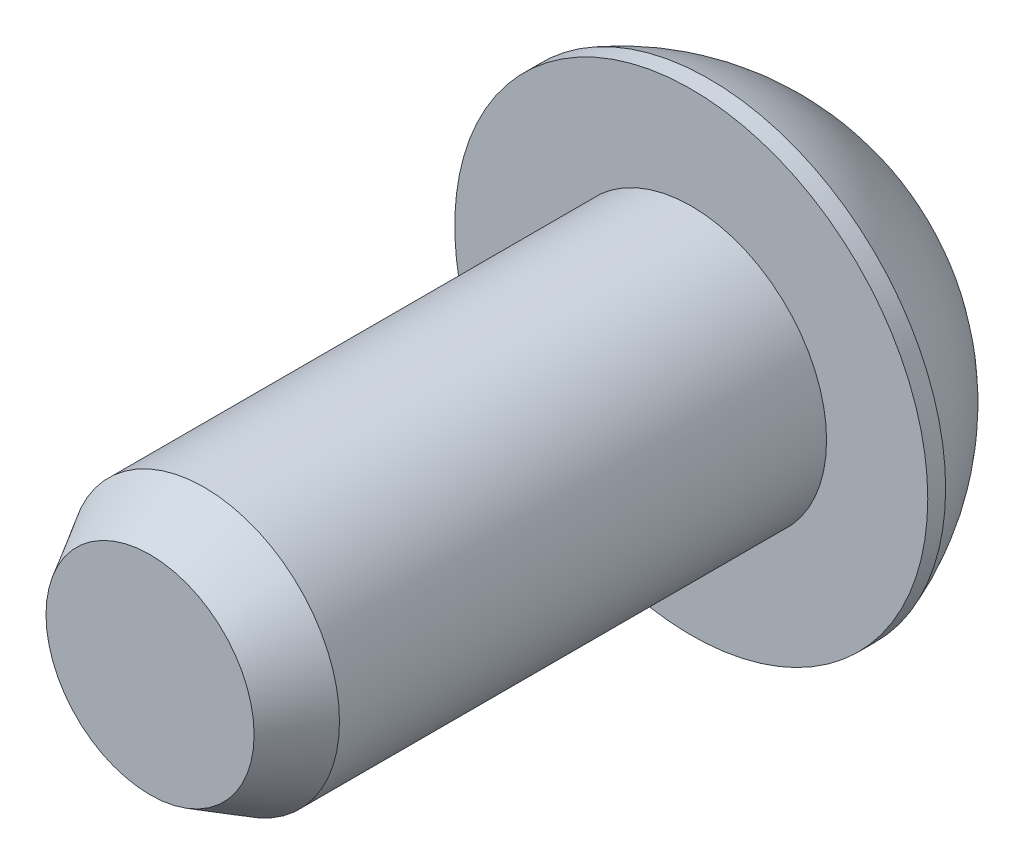
ISO-10303-21;
HEADER;
FILE_DESCRIPTION(('STEP AP214'),'2;1');
FILE_NAME('part.step','',(''),(''),'','','');
FILE_SCHEMA(('AUTOMOTIVE_DESIGN { 1 0 10303 214 1 1 1 1 }'));
ENDSEC;
DATA;
#1=APPLICATION_CONTEXT('core data for automotive mechanical design processes');
#2=APPLICATION_PROTOCOL_DEFINITION('international standard','automotive_design',2000,#1);
#3=PRODUCT_CONTEXT('',#1,'mechanical');
#4=PRODUCT('Part','Part','',(#3));
#5=PRODUCT_RELATED_PRODUCT_CATEGORY('part','',(#4));
#6=PRODUCT_DEFINITION_FORMATION('','',#4);
#7=PRODUCT_DEFINITION_CONTEXT('part definition',#1,'design');
#8=PRODUCT_DEFINITION('design','',#6,#7);
#9=PRODUCT_DEFINITION_SHAPE('','',#8);
#10=(LENGTH_UNIT() NAMED_UNIT(*) SI_UNIT(.MILLI.,.METRE.));
#11=(NAMED_UNIT(*) PLANE_ANGLE_UNIT() SI_UNIT($,.RADIAN.));
#12=(NAMED_UNIT(*) SI_UNIT($,.STERADIAN.) SOLID_ANGLE_UNIT());
#13=UNCERTAINTY_MEASURE_WITH_UNIT(LENGTH_MEASURE(1.E-05),#10,'distance_accuracy_value','');
#14=(GEOMETRIC_REPRESENTATION_CONTEXT(3) GLOBAL_UNCERTAINTY_ASSIGNED_CONTEXT((#13)) GLOBAL_UNIT_ASSIGNED_CONTEXT((#10,
#11,#12)) REPRESENTATION_CONTEXT('',''));
#15=CARTESIAN_POINT('',(0.,0.,0.));
#16=DIRECTION('',(0.,0.,1.));
#17=DIRECTION('',(1.,0.,0.));
#18=AXIS2_PLACEMENT_3D('',#15,#16,#17);
#19=CARTESIAN_POINT('',(5.54989996262454,0.,3.35279999999999));
#20=DIRECTION('',(0.,0.,1.));
#21=DIRECTION('',(1.,0.,0.));
#22=AXIS2_PLACEMENT_3D('',#19,#20,#21);
#23=PLANE('',#22);
#24=CARTESIAN_POINT('',(-1.63058039293063E-08,0.,3.35279999999999));
#25=DIRECTION('',(0.,0.,1.));
#26=DIRECTION('',(1.,0.,0.));
#27=AXIS2_PLACEMENT_3D('',#24,#25,#26);
#28=CIRCLE('',#27,5.54989997893035);
#29=CARTESIAN_POINT('',(5.54989996262455,0.,3.35279999999999));
#30=VERTEX_POINT('',#29);
#31=EDGE_CURVE('E157',#30,#30,#28,.T.);
#32=ORIENTED_EDGE('',*,*,#31,.T.);
#33=EDGE_LOOP('',(#32));
#34=FACE_BOUND('',#33,.T.);
#35=CARTESIAN_POINT('',(0.,0.,3.35279999999999));
#36=DIRECTION('',(0.,0.,1.));
#37=DIRECTION('',(1.,0.,0.));
#38=AXIS2_PLACEMENT_3D('',#35,#36,#37);
#39=CIRCLE('',#38,3.175);
#40=CARTESIAN_POINT('',(3.175,0.,3.35279999999999));
#41=VERTEX_POINT('',#40);
#42=EDGE_CURVE('E136',#41,#41,#39,.T.);
#43=ORIENTED_EDGE('',*,*,#42,.F.);
#44=EDGE_LOOP('',(#43));
#45=FACE_BOUND('',#44,.T.);
#46=ADVANCED_FACE('F46',(#34,#45),#23,.T.);
#47=CARTESIAN_POINT('',(-2.10696946001399E-08,0.,4.99835714285725));
#48=DIRECTION('',(0.,0.,1.));
#49=DIRECTION('',(1.,0.,0.));
#50=AXIS2_PLACEMENT_3D('',#47,#48,#49);
#51=SPHERICAL_SURFACE('',#50,5.92150311760007);
#52=CARTESIAN_POINT('',(-1.63058039293063E-08,0.,0.));
#53=DIRECTION('',(0.,0.,1.));
#54=DIRECTION('',(1.,0.,0.));
#55=AXIS2_PLACEMENT_3D('',#52,#53,#54);
#56=CIRCLE('',#55,3.17500000219601);
#57=CARTESIAN_POINT('',(3.1749999858902,0.,0.));
#58=VERTEX_POINT('',#57);
#59=EDGE_CURVE('E160',#58,#58,#56,.T.);
#60=ORIENTED_EDGE('',*,*,#59,.T.);
#61=EDGE_LOOP('',(#60));
#62=FACE_BOUND('',#61,.T.);
#63=CARTESIAN_POINT('',(-1.63058039293063E-08,0.,2.93369994546637));
#64=DIRECTION('',(0.,0.,1.));
#65=DIRECTION('',(1.,0.,0.));
#66=AXIS2_PLACEMENT_3D('',#63,#64,#65);
#67=CIRCLE('',#66,5.54989997893035);
#68=CARTESIAN_POINT('',(5.54989996262455,0.,2.93369994546637));
#69=VERTEX_POINT('',#68);
#70=EDGE_CURVE('E149',#69,#69,#67,.T.);
#71=ORIENTED_EDGE('',*,*,#70,.F.);
#72=EDGE_LOOP('',(#71));
#73=FACE_BOUND('',#72,.T.);
#74=ADVANCED_FACE('F176',(#62,#73),#51,.T.);
#75=CARTESIAN_POINT('',(-1.63058039293063E-08,0.,0.));
#76=DIRECTION('',(0.,0.,-1.));
#77=DIRECTION('',(-1.,0.,0.));
#78=AXIS2_PLACEMENT_3D('',#75,#76,#77);
#79=PLANE('',#78);
#80=DIRECTION('',(-0.5,0.866025403784439,0.));
#81=VECTOR('',#80,1.);
#82=CARTESIAN_POINT('',(-1.14567944042317,-1.984375,0.));
#83=LINE('',#82,#81);
#84=CARTESIAN_POINT('',(-1.14567944042317,-1.984375,0.));
#85=VERTEX_POINT('',#84);
#86=CARTESIAN_POINT('',(-2.29135888084633,0.,0.));
#87=VERTEX_POINT('',#86);
#88=EDGE_CURVE('E61',#85,#87,#83,.T.);
#89=ORIENTED_EDGE('',*,*,#88,.F.);
#90=DIRECTION('',(-1.,0.,0.));
#91=VECTOR('',#90,1.);
#92=CARTESIAN_POINT('',(1.14567944042316,-1.984375,0.));
#93=LINE('',#92,#91);
#94=CARTESIAN_POINT('',(1.14567944042316,-1.984375,0.));
#95=VERTEX_POINT('',#94);
#96=EDGE_CURVE('E145',#95,#85,#93,.T.);
#97=ORIENTED_EDGE('',*,*,#96,.F.);
#98=DIRECTION('',(-0.5,-0.866025403784438,0.));
#99=VECTOR('',#98,1.);
#100=CARTESIAN_POINT('',(2.29135888084632,0.,0.));
#101=LINE('',#100,#99);
#102=CARTESIAN_POINT('',(2.29135888084632,0.,0.));
#103=VERTEX_POINT('',#102);
#104=EDGE_CURVE('E143',#103,#95,#101,.T.);
#105=ORIENTED_EDGE('',*,*,#104,.F.);
#106=DIRECTION('',(0.5,-0.866025403784439,0.));
#107=VECTOR('',#106,1.);
#108=CARTESIAN_POINT('',(1.14567944042316,1.984375,0.));
#109=LINE('',#108,#107);
#110=CARTESIAN_POINT('',(1.14567944042316,1.984375,0.));
#111=VERTEX_POINT('',#110);
#112=EDGE_CURVE('E109',#111,#103,#109,.T.);
#113=ORIENTED_EDGE('',*,*,#112,.F.);
#114=DIRECTION('',(1.,0.,0.));
#115=VECTOR('',#114,1.);
#116=CARTESIAN_POINT('',(-1.14567944042317,1.984375,0.));
#117=LINE('',#116,#115);
#118=CARTESIAN_POINT('',(-1.14567944042317,1.984375,0.));
#119=VERTEX_POINT('',#118);
#120=EDGE_CURVE('E139',#119,#111,#117,.T.);
#121=ORIENTED_EDGE('',*,*,#120,.F.);
#122=DIRECTION('',(0.5,0.866025403784439,0.));
#123=VECTOR('',#122,1.);
#124=CARTESIAN_POINT('',(-2.29135888084633,0.,0.));
#125=LINE('',#124,#123);
#126=EDGE_CURVE('E135',#87,#119,#125,.T.);
#127=ORIENTED_EDGE('',*,*,#126,.F.);
#128=EDGE_LOOP('',(#89,#97,#105,#113,#121,#127));
#129=FACE_BOUND('',#128,.T.);
#130=ORIENTED_EDGE('',*,*,#59,.F.);
#131=EDGE_LOOP('',(#130));
#132=FACE_BOUND('',#131,.T.);
#133=ADVANCED_FACE('F182',(#129,#132),#79,.T.);
#134=CARTESIAN_POINT('',(-1.63058039293063E-08,0.,0.));
#135=DIRECTION('',(0.,0.,1.));
#136=DIRECTION('',(1.,0.,0.));
#137=AXIS2_PLACEMENT_3D('',#134,#135,#136);
#138=CYLINDRICAL_SURFACE('',#137,5.54989997893035);
#139=ORIENTED_EDGE('',*,*,#70,.T.);
#140=EDGE_LOOP('',(#139));
#141=FACE_BOUND('',#140,.T.);
#142=ORIENTED_EDGE('',*,*,#31,.F.);
#143=EDGE_LOOP('',(#142));
#144=FACE_BOUND('',#143,.T.);
#145=ADVANCED_FACE('F187',(#141,#144),#138,.T.);
#146=CARTESIAN_POINT('',(-1.14567944042317,-1.984375,2.2225));
#147=DIRECTION('',(-0.866025403784439,-0.5,0.));
#148=DIRECTION('',(0.5,-0.866025403784439,0.));
#149=AXIS2_PLACEMENT_3D('',#146,#147,#148);
#150=PLANE('',#149);
#151=ORIENTED_EDGE('',*,*,#88,.T.);
#152=DIRECTION('',(0.,0.,-1.));
#153=VECTOR('',#152,1.);
#154=CARTESIAN_POINT('',(-2.29135888084633,0.,2.2225));
#155=LINE('',#154,#153);
#156=CARTESIAN_POINT('',(-2.29135888084633,0.,2.2225));
#157=VERTEX_POINT('',#156);
#158=EDGE_CURVE('E91',#157,#87,#155,.T.);
#159=ORIENTED_EDGE('',*,*,#158,.F.);
#160=DIRECTION('',(-0.5,0.866025403784439,0.));
#161=VECTOR('',#160,1.);
#162=CARTESIAN_POINT('',(-1.14567944042317,-1.984375,2.2225));
#163=LINE('',#162,#161);
#164=CARTESIAN_POINT('',(-1.14567944042317,-1.984375,2.2225));
#165=VERTEX_POINT('',#164);
#166=EDGE_CURVE('E147',#165,#157,#163,.T.);
#167=ORIENTED_EDGE('',*,*,#166,.F.);
#168=DIRECTION('',(0.,0.,-1.));
#169=VECTOR('',#168,1.);
#170=CARTESIAN_POINT('',(-1.14567944042317,-1.984375,2.2225));
#171=LINE('',#170,#169);
#172=EDGE_CURVE('E69',#165,#85,#171,.T.);
#173=ORIENTED_EDGE('',*,*,#172,.T.);
#174=EDGE_LOOP('',(#151,#159,#167,#173));
#175=FACE_BOUND('',#174,.T.);
#176=ADVANCED_FACE('F194',(#175),#150,.F.);
#177=CARTESIAN_POINT('',(1.14567944042316,-1.984375,2.2225));
#178=DIRECTION('',(0.,-1.,0.));
#179=DIRECTION('',(1.,0.,0.));
#180=AXIS2_PLACEMENT_3D('',#177,#178,#179);
#181=PLANE('',#180);
#182=ORIENTED_EDGE('',*,*,#96,.T.);
#183=ORIENTED_EDGE('',*,*,#172,.F.);
#184=DIRECTION('',(-1.,0.,0.));
#185=VECTOR('',#184,1.);
#186=CARTESIAN_POINT('',(1.14567944042316,-1.984375,2.2225));
#187=LINE('',#186,#185);
#188=CARTESIAN_POINT('',(1.14567944042316,-1.984375,2.2225));
#189=VERTEX_POINT('',#188);
#190=EDGE_CURVE('E121',#189,#165,#187,.T.);
#191=ORIENTED_EDGE('',*,*,#190,.F.);
#192=DIRECTION('',(0.,0.,-1.));
#193=VECTOR('',#192,1.);
#194=CARTESIAN_POINT('',(1.14567944042316,-1.984375,2.2225));
#195=LINE('',#194,#193);
#196=EDGE_CURVE('E113',#189,#95,#195,.T.);
#197=ORIENTED_EDGE('',*,*,#196,.T.);
#198=EDGE_LOOP('',(#182,#183,#191,#197));
#199=FACE_BOUND('',#198,.T.);
#200=ADVANCED_FACE('F220',(#199),#181,.F.);
#201=CARTESIAN_POINT('',(2.29135888084632,0.,2.2225));
#202=DIRECTION('',(0.866025403784438,-0.5,0.));
#203=DIRECTION('',(0.5,0.866025403784439,0.));
#204=AXIS2_PLACEMENT_3D('',#201,#202,#203);
#205=PLANE('',#204);
#206=ORIENTED_EDGE('',*,*,#104,.T.);
#207=ORIENTED_EDGE('',*,*,#196,.F.);
#208=DIRECTION('',(-0.5,-0.866025403784438,0.));
#209=VECTOR('',#208,1.);
#210=CARTESIAN_POINT('',(2.29135888084632,0.,2.2225));
#211=LINE('',#210,#209);
#212=CARTESIAN_POINT('',(2.29135888084632,0.,2.2225));
#213=VERTEX_POINT('',#212);
#214=EDGE_CURVE('E117',#213,#189,#211,.T.);
#215=ORIENTED_EDGE('',*,*,#214,.F.);
#216=DIRECTION('',(0.,0.,-1.));
#217=VECTOR('',#216,1.);
#218=CARTESIAN_POINT('',(2.29135888084632,0.,2.2225));
#219=LINE('',#218,#217);
#220=EDGE_CURVE('E102',#213,#103,#219,.T.);
#221=ORIENTED_EDGE('',*,*,#220,.T.);
#222=EDGE_LOOP('',(#206,#207,#215,#221));
#223=FACE_BOUND('',#222,.T.);
#224=ADVANCED_FACE('F118',(#223),#205,.F.);
#225=CARTESIAN_POINT('',(1.14567944042316,1.984375,2.2225));
#226=DIRECTION('',(0.866025403784439,0.5,0.));
#227=DIRECTION('',(-0.5,0.866025403784439,0.));
#228=AXIS2_PLACEMENT_3D('',#225,#226,#227);
#229=PLANE('',#228);
#230=ORIENTED_EDGE('',*,*,#112,.T.);
#231=ORIENTED_EDGE('',*,*,#220,.F.);
#232=DIRECTION('',(0.5,-0.866025403784439,0.));
#233=VECTOR('',#232,1.);
#234=CARTESIAN_POINT('',(1.14567944042316,1.984375,2.2225));
#235=LINE('',#234,#233);
#236=CARTESIAN_POINT('',(1.14567944042316,1.984375,2.2225));
#237=VERTEX_POINT('',#236);
#238=EDGE_CURVE('E106',#237,#213,#235,.T.);
#239=ORIENTED_EDGE('',*,*,#238,.F.);
#240=DIRECTION('',(0.,0.,-1.));
#241=VECTOR('',#240,1.);
#242=CARTESIAN_POINT('',(1.14567944042316,1.984375,2.2225));
#243=LINE('',#242,#241);
#244=EDGE_CURVE('E114',#237,#111,#243,.T.);
#245=ORIENTED_EDGE('',*,*,#244,.T.);
#246=EDGE_LOOP('',(#230,#231,#239,#245));
#247=FACE_BOUND('',#246,.T.);
#248=ADVANCED_FACE('F104',(#247),#229,.F.);
#249=CARTESIAN_POINT('',(-1.14567944042317,1.984375,2.2225));
#250=DIRECTION('',(0.,1.,0.));
#251=DIRECTION('',(-1.,0.,0.));
#252=AXIS2_PLACEMENT_3D('',#249,#250,#251);
#253=PLANE('',#252);
#254=ORIENTED_EDGE('',*,*,#120,.T.);
#255=ORIENTED_EDGE('',*,*,#244,.F.);
#256=DIRECTION('',(1.,0.,0.));
#257=VECTOR('',#256,1.);
#258=CARTESIAN_POINT('',(-1.14567944042317,1.984375,2.2225));
#259=LINE('',#258,#257);
#260=CARTESIAN_POINT('',(-1.14567944042317,1.984375,2.2225));
#261=VERTEX_POINT('',#260);
#262=EDGE_CURVE('E127',#261,#237,#259,.T.);
#263=ORIENTED_EDGE('',*,*,#262,.F.);
#264=DIRECTION('',(0.,0.,-1.));
#265=VECTOR('',#264,1.);
#266=CARTESIAN_POINT('',(-1.14567944042317,1.984375,2.2225));
#267=LINE('',#266,#265);
#268=EDGE_CURVE('E152',#261,#119,#267,.T.);
#269=ORIENTED_EDGE('',*,*,#268,.T.);
#270=EDGE_LOOP('',(#254,#255,#263,#269));
#271=FACE_BOUND('',#270,.T.);
#272=ADVANCED_FACE('F227',(#271),#253,.F.);
#273=CARTESIAN_POINT('',(-2.29135888084633,0.,2.2225));
#274=DIRECTION('',(-0.866025403784439,0.5,0.));
#275=DIRECTION('',(-0.5,-0.866025403784439,0.));
#276=AXIS2_PLACEMENT_3D('',#273,#274,#275);
#277=PLANE('',#276);
#278=ORIENTED_EDGE('',*,*,#126,.T.);
#279=ORIENTED_EDGE('',*,*,#268,.F.);
#280=DIRECTION('',(0.5,0.866025403784439,0.));
#281=VECTOR('',#280,1.);
#282=CARTESIAN_POINT('',(-2.29135888084633,0.,2.2225));
#283=LINE('',#282,#281);
#284=EDGE_CURVE('E129',#157,#261,#283,.T.);
#285=ORIENTED_EDGE('',*,*,#284,.F.);
#286=ORIENTED_EDGE('',*,*,#158,.T.);
#287=EDGE_LOOP('',(#278,#279,#285,#286));
#288=FACE_BOUND('',#287,.T.);
#289=ADVANCED_FACE('F206',(#288),#277,.F.);
#290=CARTESIAN_POINT('',(-2.29135888084633,0.,2.2225));
#291=DIRECTION('',(0.,0.,-1.));
#292=DIRECTION('',(-1.,0.,0.));
#293=AXIS2_PLACEMENT_3D('',#290,#291,#292);
#294=PLANE('',#293);
#295=ORIENTED_EDGE('',*,*,#166,.T.);
#296=ORIENTED_EDGE('',*,*,#284,.T.);
#297=ORIENTED_EDGE('',*,*,#262,.T.);
#298=ORIENTED_EDGE('',*,*,#238,.T.);
#299=ORIENTED_EDGE('',*,*,#214,.T.);
#300=ORIENTED_EDGE('',*,*,#190,.T.);
#301=EDGE_LOOP('',(#295,#296,#297,#298,#299,#300));
#302=FACE_BOUND('',#301,.T.);
#303=ADVANCED_FACE('F124',(#302),#294,.T.);
#304=CARTESIAN_POINT('',(0.,0.,16.0528));
#305=DIRECTION('',(0.,0.,-1.));
#306=DIRECTION('',(-1.,0.,0.));
#307=AXIS2_PLACEMENT_3D('',#304,#305,#306);
#308=CYLINDRICAL_SURFACE('',#307,3.175);
#309=CARTESIAN_POINT('',(0.,0.,14.7828));
#310=DIRECTION('',(0.,0.,1.));
#311=DIRECTION('',(1.,0.,0.));
#312=AXIS2_PLACEMENT_3D('',#309,#310,#311);
#313=CIRCLE('',#312,3.175);
#314=CARTESIAN_POINT('',(3.175,0.,14.7828));
#315=VERTEX_POINT('',#314);
#316=EDGE_CURVE('E13',#315,#315,#313,.F.);
#317=ORIENTED_EDGE('',*,*,#316,.T.);
#318=EDGE_LOOP('',(#317));
#319=FACE_BOUND('',#318,.T.);
#320=ORIENTED_EDGE('',*,*,#42,.T.);
#321=EDGE_LOOP('',(#320));
#322=FACE_BOUND('',#321,.T.);
#323=ADVANCED_FACE('F172',(#319,#322),#308,.T.);
#324=CARTESIAN_POINT('',(0.,0.,16.0528));
#325=DIRECTION('',(0.,0.,1.));
#326=DIRECTION('',(1.,0.,0.));
#327=AXIS2_PLACEMENT_3D('',#324,#325,#326);
#328=PLANE('',#327);
#329=CARTESIAN_POINT('',(0.,0.,16.0528));
#330=DIRECTION('',(0.,0.,1.));
#331=DIRECTION('',(1.,0.,0.));
#332=AXIS2_PLACEMENT_3D('',#329,#330,#331);
#333=CIRCLE('',#332,2.44176515812917);
#334=CARTESIAN_POINT('',(2.44176515812917,0.,16.0528));
#335=VERTEX_POINT('',#334);
#336=EDGE_CURVE('E54',#335,#335,#333,.T.);
#337=ORIENTED_EDGE('',*,*,#336,.T.);
#338=EDGE_LOOP('',(#337));
#339=FACE_BOUND('',#338,.T.);
#340=ADVANCED_FACE('F165',(#339),#328,.T.);
#341=CARTESIAN_POINT('',(0.,0.,16.0528));
#342=DIRECTION('',(0.,0.,-1.));
#343=DIRECTION('',(-1.,0.,0.));
#344=AXIS2_PLACEMENT_3D('',#341,#342,#343);
#345=CONICAL_SURFACE('',#344,2.44176515812917,0.523598775598296);
#346=ORIENTED_EDGE('',*,*,#316,.F.);
#347=EDGE_LOOP('',(#346));
#348=FACE_BOUND('',#347,.T.);
#349=ORIENTED_EDGE('',*,*,#336,.F.);
#350=EDGE_LOOP('',(#349));
#351=FACE_BOUND('',#350,.T.);
#352=ADVANCED_FACE('F48',(#348,#351),#345,.T.);
#353=CLOSED_SHELL('',(#46,#74,#133,#145,#176,#200,#224,#248,#272,#289,#303,#323,#340,#352));
#354=MANIFOLD_SOLID_BREP('B2',#353);
#355=ADVANCED_BREP_SHAPE_REPRESENTATION('',(#18,#354),#14);
#356=SHAPE_DEFINITION_REPRESENTATION(#9,#355);
ENDSEC;
END-ISO-10303-21;
